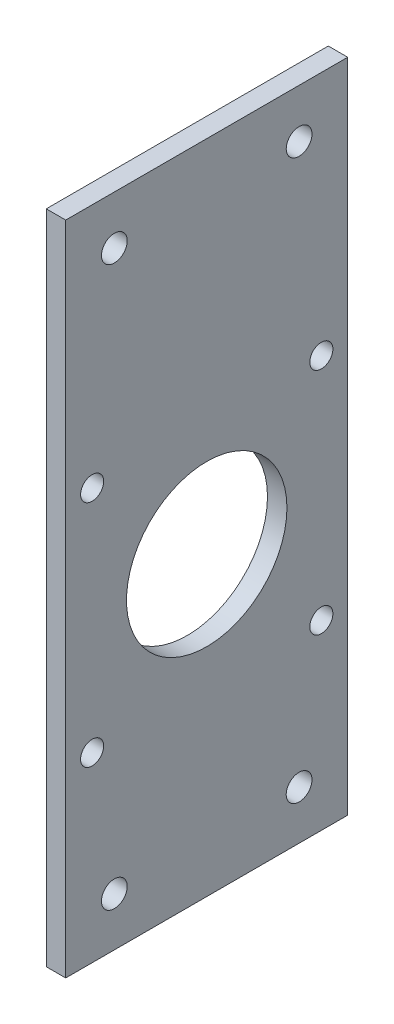
ISO-10303-21;
HEADER;
FILE_DESCRIPTION(('STEP AP214'),'2;1');
FILE_NAME('part.step','',(''),(''),'','','');
FILE_SCHEMA(('AUTOMOTIVE_DESIGN { 1 0 10303 214 1 1 1 1 }'));
ENDSEC;
DATA;
#1=APPLICATION_CONTEXT('core data for automotive mechanical design processes');
#2=APPLICATION_PROTOCOL_DEFINITION('international standard','automotive_design',2000,#1);
#3=PRODUCT_CONTEXT('',#1,'mechanical');
#4=PRODUCT('Part','Part','',(#3));
#5=PRODUCT_RELATED_PRODUCT_CATEGORY('part','',(#4));
#6=PRODUCT_DEFINITION_FORMATION('','',#4);
#7=PRODUCT_DEFINITION_CONTEXT('part definition',#1,'design');
#8=PRODUCT_DEFINITION('design','',#6,#7);
#9=PRODUCT_DEFINITION_SHAPE('','',#8);
#10=(LENGTH_UNIT() NAMED_UNIT(*) SI_UNIT(.MILLI.,.METRE.));
#11=(NAMED_UNIT(*) PLANE_ANGLE_UNIT() SI_UNIT($,.RADIAN.));
#12=(NAMED_UNIT(*) SI_UNIT($,.STERADIAN.) SOLID_ANGLE_UNIT());
#13=UNCERTAINTY_MEASURE_WITH_UNIT(LENGTH_MEASURE(1.E-05),#10,'distance_accuracy_value','');
#14=(GEOMETRIC_REPRESENTATION_CONTEXT(3) GLOBAL_UNCERTAINTY_ASSIGNED_CONTEXT((#13)) GLOBAL_UNIT_ASSIGNED_CONTEXT((#10,
#11,#12)) REPRESENTATION_CONTEXT('',''));
#15=CARTESIAN_POINT('',(0.,0.,0.));
#16=DIRECTION('',(0.,0.,1.));
#17=DIRECTION('',(1.,0.,0.));
#18=AXIS2_PLACEMENT_3D('',#15,#16,#17);
#19=CARTESIAN_POINT('',(4.,0.,0.));
#20=DIRECTION('',(1.,0.,0.));
#21=DIRECTION('',(0.,0.,-1.));
#22=AXIS2_PLACEMENT_3D('',#19,#20,#21);
#23=PLANE('',#22);
#24=CARTESIAN_POINT('',(4.,-57.4999999999999,19.));
#25=DIRECTION('',(1.,0.,0.));
#26=DIRECTION('',(0.,0.,1.));
#27=AXIS2_PLACEMENT_3D('',#24,#25,#26);
#28=CIRCLE('',#27,2.65);
#29=CARTESIAN_POINT('',(4.,-57.4999999999999,21.65));
#30=VERTEX_POINT('',#29);
#31=EDGE_CURVE('E151',#30,#30,#28,.T.);
#32=ORIENTED_EDGE('',*,*,#31,.F.);
#33=EDGE_LOOP('',(#32));
#34=FACE_BOUND('',#33,.T.);
#35=CARTESIAN_POINT('',(4.,57.5,19.));
#36=DIRECTION('',(1.,0.,0.));
#37=DIRECTION('',(0.,0.,-1.));
#38=AXIS2_PLACEMENT_3D('',#35,#36,#37);
#39=CIRCLE('',#38,2.65);
#40=CARTESIAN_POINT('',(4.,57.5,16.35));
#41=VERTEX_POINT('',#40);
#42=EDGE_CURVE('E139',#41,#41,#39,.T.);
#43=ORIENTED_EDGE('',*,*,#42,.F.);
#44=EDGE_LOOP('',(#43));
#45=FACE_BOUND('',#44,.T.);
#46=CARTESIAN_POINT('',(4.,-30.07,23.57));
#47=DIRECTION('',(1.,0.,0.));
#48=DIRECTION('',(0.,0.,-1.));
#49=AXIS2_PLACEMENT_3D('',#46,#47,#48);
#50=CIRCLE('',#49,2.375);
#51=CARTESIAN_POINT('',(4.,-30.07,21.195));
#52=VERTEX_POINT('',#51);
#53=EDGE_CURVE('E127',#52,#52,#50,.T.);
#54=ORIENTED_EDGE('',*,*,#53,.F.);
#55=EDGE_LOOP('',(#54));
#56=FACE_BOUND('',#55,.T.);
#57=CARTESIAN_POINT('',(4.,17.07,-23.57));
#58=DIRECTION('',(1.,0.,0.));
#59=DIRECTION('',(0.,0.,-1.));
#60=AXIS2_PLACEMENT_3D('',#57,#58,#59);
#61=CIRCLE('',#60,2.375);
#62=CARTESIAN_POINT('',(4.,17.07,-25.945));
#63=VERTEX_POINT('',#62);
#64=EDGE_CURVE('E115',#63,#63,#61,.T.);
#65=ORIENTED_EDGE('',*,*,#64,.F.);
#66=EDGE_LOOP('',(#65));
#67=FACE_BOUND('',#66,.T.);
#68=DIRECTION('',(0.,-1.,0.));
#69=VECTOR('',#68,1.);
#70=CARTESIAN_POINT('',(4.,-67.5,29.));
#71=LINE('',#70,#69);
#72=CARTESIAN_POINT('',(4.,67.5,29.));
#73=VERTEX_POINT('',#72);
#74=CARTESIAN_POINT('',(4.,-67.5,29.));
#75=VERTEX_POINT('',#74);
#76=EDGE_CURVE('E85',#73,#75,#71,.T.);
#77=ORIENTED_EDGE('',*,*,#76,.T.);
#78=DIRECTION('',(0.,0.,-1.));
#79=VECTOR('',#78,1.);
#80=CARTESIAN_POINT('',(4.,-67.5,-29.));
#81=LINE('',#80,#79);
#82=CARTESIAN_POINT('',(4.,-67.5,-29.));
#83=VERTEX_POINT('',#82);
#84=EDGE_CURVE('E80',#75,#83,#81,.T.);
#85=ORIENTED_EDGE('',*,*,#84,.T.);
#86=DIRECTION('',(0.,1.,0.));
#87=VECTOR('',#86,1.);
#88=CARTESIAN_POINT('',(4.,-67.5,-29.));
#89=LINE('',#88,#87);
#90=CARTESIAN_POINT('',(4.,67.5,-29.));
#91=VERTEX_POINT('',#90);
#92=EDGE_CURVE('E83',#83,#91,#89,.T.);
#93=ORIENTED_EDGE('',*,*,#92,.T.);
#94=DIRECTION('',(0.,0.,1.));
#95=VECTOR('',#94,1.);
#96=CARTESIAN_POINT('',(4.,67.5,-29.));
#97=LINE('',#96,#95);
#98=EDGE_CURVE('E50',#91,#73,#97,.T.);
#99=ORIENTED_EDGE('',*,*,#98,.T.);
#100=EDGE_LOOP('',(#77,#85,#93,#99));
#101=FACE_BOUND('',#100,.T.);
#102=CARTESIAN_POINT('',(4.,-6.50000000000001,0.));
#103=DIRECTION('',(1.,0.,0.));
#104=DIRECTION('',(0.,0.,-1.));
#105=AXIS2_PLACEMENT_3D('',#102,#103,#104);
#106=CIRCLE('',#105,16.5);
#107=CARTESIAN_POINT('',(4.,-6.50000000000001,-16.5));
#108=VERTEX_POINT('',#107);
#109=EDGE_CURVE('E100',#108,#108,#106,.T.);
#110=ORIENTED_EDGE('',*,*,#109,.F.);
#111=EDGE_LOOP('',(#110));
#112=FACE_BOUND('',#111,.T.);
#113=CARTESIAN_POINT('',(4.,17.07,23.57));
#114=DIRECTION('',(1.,0.,0.));
#115=DIRECTION('',(0.,0.,1.));
#116=AXIS2_PLACEMENT_3D('',#113,#114,#115);
#117=CIRCLE('',#116,2.375);
#118=CARTESIAN_POINT('',(4.,17.07,25.945));
#119=VERTEX_POINT('',#118);
#120=EDGE_CURVE('E121',#119,#119,#117,.T.);
#121=ORIENTED_EDGE('',*,*,#120,.F.);
#122=EDGE_LOOP('',(#121));
#123=FACE_BOUND('',#122,.T.);
#124=CARTESIAN_POINT('',(4.,-30.07,-23.57));
#125=DIRECTION('',(1.,0.,0.));
#126=DIRECTION('',(0.,0.,1.));
#127=AXIS2_PLACEMENT_3D('',#124,#125,#126);
#128=CIRCLE('',#127,2.375);
#129=CARTESIAN_POINT('',(4.,-30.07,-21.195));
#130=VERTEX_POINT('',#129);
#131=EDGE_CURVE('E133',#130,#130,#128,.T.);
#132=ORIENTED_EDGE('',*,*,#131,.F.);
#133=EDGE_LOOP('',(#132));
#134=FACE_BOUND('',#133,.T.);
#135=CARTESIAN_POINT('',(4.,57.5,-19.));
#136=DIRECTION('',(1.,0.,0.));
#137=DIRECTION('',(0.,0.,1.));
#138=AXIS2_PLACEMENT_3D('',#135,#136,#137);
#139=CIRCLE('',#138,2.65);
#140=CARTESIAN_POINT('',(4.,57.5,-16.35));
#141=VERTEX_POINT('',#140);
#142=EDGE_CURVE('E145',#141,#141,#139,.T.);
#143=ORIENTED_EDGE('',*,*,#142,.F.);
#144=EDGE_LOOP('',(#143));
#145=FACE_BOUND('',#144,.T.);
#146=CARTESIAN_POINT('',(4.,-57.5,-19.));
#147=DIRECTION('',(1.,0.,0.));
#148=DIRECTION('',(0.,0.,-1.));
#149=AXIS2_PLACEMENT_3D('',#146,#147,#148);
#150=CIRCLE('',#149,2.65);
#151=CARTESIAN_POINT('',(4.,-57.5,-21.65));
#152=VERTEX_POINT('',#151);
#153=EDGE_CURVE('E157',#152,#152,#150,.T.);
#154=ORIENTED_EDGE('',*,*,#153,.F.);
#155=EDGE_LOOP('',(#154));
#156=FACE_BOUND('',#155,.T.);
#157=ADVANCED_FACE('F33',(#34,#45,#56,#67,#101,#112,#123,#134,#145,#156),#23,.T.);
#158=CARTESIAN_POINT('',(0.,0.,0.));
#159=DIRECTION('',(1.,0.,0.));
#160=DIRECTION('',(0.,0.,-1.));
#161=AXIS2_PLACEMENT_3D('',#158,#159,#160);
#162=PLANE('',#161);
#163=DIRECTION('',(0.,-1.,0.));
#164=VECTOR('',#163,1.);
#165=CARTESIAN_POINT('',(0.,-67.5,29.));
#166=LINE('',#165,#164);
#167=CARTESIAN_POINT('',(0.,67.5,29.));
#168=VERTEX_POINT('',#167);
#169=CARTESIAN_POINT('',(0.,-67.5,29.));
#170=VERTEX_POINT('',#169);
#171=EDGE_CURVE('E97',#168,#170,#166,.T.);
#172=ORIENTED_EDGE('',*,*,#171,.F.);
#173=DIRECTION('',(0.,0.,1.));
#174=VECTOR('',#173,1.);
#175=CARTESIAN_POINT('',(0.,67.5,-29.));
#176=LINE('',#175,#174);
#177=CARTESIAN_POINT('',(0.,67.5,-29.));
#178=VERTEX_POINT('',#177);
#179=EDGE_CURVE('E73',#178,#168,#176,.T.);
#180=ORIENTED_EDGE('',*,*,#179,.F.);
#181=DIRECTION('',(0.,1.,0.));
#182=VECTOR('',#181,1.);
#183=CARTESIAN_POINT('',(0.,-67.5,-29.));
#184=LINE('',#183,#182);
#185=CARTESIAN_POINT('',(0.,-67.5,-29.));
#186=VERTEX_POINT('',#185);
#187=EDGE_CURVE('E67',#186,#178,#184,.T.);
#188=ORIENTED_EDGE('',*,*,#187,.F.);
#189=DIRECTION('',(0.,0.,-1.));
#190=VECTOR('',#189,1.);
#191=CARTESIAN_POINT('',(0.,-67.5,-29.));
#192=LINE('',#191,#190);
#193=EDGE_CURVE('E89',#170,#186,#192,.T.);
#194=ORIENTED_EDGE('',*,*,#193,.F.);
#195=EDGE_LOOP('',(#172,#180,#188,#194));
#196=FACE_BOUND('',#195,.T.);
#197=CARTESIAN_POINT('',(0.,-6.50000000000001,0.));
#198=DIRECTION('',(1.,0.,0.));
#199=DIRECTION('',(0.,0.,-1.));
#200=AXIS2_PLACEMENT_3D('',#197,#198,#199);
#201=CIRCLE('',#200,16.5);
#202=CARTESIAN_POINT('',(0.,-6.50000000000001,-16.5));
#203=VERTEX_POINT('',#202);
#204=EDGE_CURVE('E112',#203,#203,#201,.T.);
#205=ORIENTED_EDGE('',*,*,#204,.T.);
#206=EDGE_LOOP('',(#205));
#207=FACE_BOUND('',#206,.T.);
#208=CARTESIAN_POINT('',(0.,17.07,-23.57));
#209=DIRECTION('',(1.,0.,0.));
#210=DIRECTION('',(0.,0.,-1.));
#211=AXIS2_PLACEMENT_3D('',#208,#209,#210);
#212=CIRCLE('',#211,2.375);
#213=CARTESIAN_POINT('',(0.,17.07,-25.945));
#214=VERTEX_POINT('',#213);
#215=EDGE_CURVE('E118',#214,#214,#212,.T.);
#216=ORIENTED_EDGE('',*,*,#215,.T.);
#217=EDGE_LOOP('',(#216));
#218=FACE_BOUND('',#217,.T.);
#219=CARTESIAN_POINT('',(0.,17.07,23.57));
#220=DIRECTION('',(1.,0.,0.));
#221=DIRECTION('',(0.,0.,1.));
#222=AXIS2_PLACEMENT_3D('',#219,#220,#221);
#223=CIRCLE('',#222,2.375);
#224=CARTESIAN_POINT('',(0.,17.07,25.945));
#225=VERTEX_POINT('',#224);
#226=EDGE_CURVE('E124',#225,#225,#223,.T.);
#227=ORIENTED_EDGE('',*,*,#226,.T.);
#228=EDGE_LOOP('',(#227));
#229=FACE_BOUND('',#228,.T.);
#230=CARTESIAN_POINT('',(0.,-30.07,23.57));
#231=DIRECTION('',(1.,0.,0.));
#232=DIRECTION('',(0.,0.,-1.));
#233=AXIS2_PLACEMENT_3D('',#230,#231,#232);
#234=CIRCLE('',#233,2.375);
#235=CARTESIAN_POINT('',(0.,-30.07,21.195));
#236=VERTEX_POINT('',#235);
#237=EDGE_CURVE('E130',#236,#236,#234,.T.);
#238=ORIENTED_EDGE('',*,*,#237,.T.);
#239=EDGE_LOOP('',(#238));
#240=FACE_BOUND('',#239,.T.);
#241=CARTESIAN_POINT('',(0.,-30.07,-23.57));
#242=DIRECTION('',(1.,0.,0.));
#243=DIRECTION('',(0.,0.,1.));
#244=AXIS2_PLACEMENT_3D('',#241,#242,#243);
#245=CIRCLE('',#244,2.375);
#246=CARTESIAN_POINT('',(0.,-30.07,-21.195));
#247=VERTEX_POINT('',#246);
#248=EDGE_CURVE('E136',#247,#247,#245,.T.);
#249=ORIENTED_EDGE('',*,*,#248,.T.);
#250=EDGE_LOOP('',(#249));
#251=FACE_BOUND('',#250,.T.);
#252=CARTESIAN_POINT('',(0.,57.5,19.));
#253=DIRECTION('',(1.,0.,0.));
#254=DIRECTION('',(0.,0.,-1.));
#255=AXIS2_PLACEMENT_3D('',#252,#253,#254);
#256=CIRCLE('',#255,2.65);
#257=CARTESIAN_POINT('',(0.,57.5,16.35));
#258=VERTEX_POINT('',#257);
#259=EDGE_CURVE('E142',#258,#258,#256,.T.);
#260=ORIENTED_EDGE('',*,*,#259,.T.);
#261=EDGE_LOOP('',(#260));
#262=FACE_BOUND('',#261,.T.);
#263=CARTESIAN_POINT('',(0.,57.5,-19.));
#264=DIRECTION('',(1.,0.,0.));
#265=DIRECTION('',(0.,0.,1.));
#266=AXIS2_PLACEMENT_3D('',#263,#264,#265);
#267=CIRCLE('',#266,2.65);
#268=CARTESIAN_POINT('',(0.,57.5,-16.35));
#269=VERTEX_POINT('',#268);
#270=EDGE_CURVE('E148',#269,#269,#267,.T.);
#271=ORIENTED_EDGE('',*,*,#270,.T.);
#272=EDGE_LOOP('',(#271));
#273=FACE_BOUND('',#272,.T.);
#274=CARTESIAN_POINT('',(0.,-57.4999999999999,19.));
#275=DIRECTION('',(1.,0.,0.));
#276=DIRECTION('',(0.,0.,1.));
#277=AXIS2_PLACEMENT_3D('',#274,#275,#276);
#278=CIRCLE('',#277,2.65);
#279=CARTESIAN_POINT('',(0.,-57.4999999999999,21.65));
#280=VERTEX_POINT('',#279);
#281=EDGE_CURVE('E154',#280,#280,#278,.T.);
#282=ORIENTED_EDGE('',*,*,#281,.T.);
#283=EDGE_LOOP('',(#282));
#284=FACE_BOUND('',#283,.T.);
#285=CARTESIAN_POINT('',(0.,-57.5,-19.));
#286=DIRECTION('',(1.,0.,0.));
#287=DIRECTION('',(0.,0.,-1.));
#288=AXIS2_PLACEMENT_3D('',#285,#286,#287);
#289=CIRCLE('',#288,2.65);
#290=CARTESIAN_POINT('',(0.,-57.5,-21.65));
#291=VERTEX_POINT('',#290);
#292=EDGE_CURVE('E160',#291,#291,#289,.T.);
#293=ORIENTED_EDGE('',*,*,#292,.T.);
#294=EDGE_LOOP('',(#293));
#295=FACE_BOUND('',#294,.T.);
#296=ADVANCED_FACE('F108',(#196,#207,#218,#229,#240,#251,#262,#273,#284,#295),#162,.F.);
#297=CARTESIAN_POINT('',(4.,-67.5,29.));
#298=DIRECTION('',(0.,0.,-1.));
#299=DIRECTION('',(-1.,0.,0.));
#300=AXIS2_PLACEMENT_3D('',#297,#298,#299);
#301=PLANE('',#300);
#302=ORIENTED_EDGE('',*,*,#171,.T.);
#303=DIRECTION('',(-1.,0.,0.));
#304=VECTOR('',#303,1.);
#305=CARTESIAN_POINT('',(4.,-67.5,29.));
#306=LINE('',#305,#304);
#307=EDGE_CURVE('E11',#75,#170,#306,.T.);
#308=ORIENTED_EDGE('',*,*,#307,.F.);
#309=ORIENTED_EDGE('',*,*,#76,.F.);
#310=DIRECTION('',(-1.,0.,0.));
#311=VECTOR('',#310,1.);
#312=CARTESIAN_POINT('',(4.,67.5,29.));
#313=LINE('',#312,#311);
#314=EDGE_CURVE('E93',#73,#168,#313,.T.);
#315=ORIENTED_EDGE('',*,*,#314,.T.);
#316=EDGE_LOOP('',(#302,#308,#309,#315));
#317=FACE_BOUND('',#316,.T.);
#318=ADVANCED_FACE('F35',(#317),#301,.F.);
#319=CARTESIAN_POINT('',(4.,-67.5,-29.));
#320=DIRECTION('',(0.,1.,0.));
#321=DIRECTION('',(0.,0.,1.));
#322=AXIS2_PLACEMENT_3D('',#319,#320,#321);
#323=PLANE('',#322);
#324=ORIENTED_EDGE('',*,*,#193,.T.);
#325=DIRECTION('',(-1.,0.,0.));
#326=VECTOR('',#325,1.);
#327=CARTESIAN_POINT('',(4.,-67.5,-29.));
#328=LINE('',#327,#326);
#329=EDGE_CURVE('E42',#83,#186,#328,.T.);
#330=ORIENTED_EDGE('',*,*,#329,.F.);
#331=ORIENTED_EDGE('',*,*,#84,.F.);
#332=ORIENTED_EDGE('',*,*,#307,.T.);
#333=EDGE_LOOP('',(#324,#330,#331,#332));
#334=FACE_BOUND('',#333,.T.);
#335=ADVANCED_FACE('F88',(#334),#323,.F.);
#336=CARTESIAN_POINT('',(4.,-67.5,-29.));
#337=DIRECTION('',(0.,0.,1.));
#338=DIRECTION('',(0.,-1.,0.));
#339=AXIS2_PLACEMENT_3D('',#336,#337,#338);
#340=PLANE('',#339);
#341=ORIENTED_EDGE('',*,*,#187,.T.);
#342=DIRECTION('',(-1.,0.,0.));
#343=VECTOR('',#342,1.);
#344=CARTESIAN_POINT('',(4.,67.5,-29.));
#345=LINE('',#344,#343);
#346=EDGE_CURVE('E90',#91,#178,#345,.T.);
#347=ORIENTED_EDGE('',*,*,#346,.F.);
#348=ORIENTED_EDGE('',*,*,#92,.F.);
#349=ORIENTED_EDGE('',*,*,#329,.T.);
#350=EDGE_LOOP('',(#341,#347,#348,#349));
#351=FACE_BOUND('',#350,.T.);
#352=ADVANCED_FACE('F91',(#351),#340,.F.);
#353=CARTESIAN_POINT('',(4.,67.5,-29.));
#354=DIRECTION('',(0.,-1.,0.));
#355=DIRECTION('',(0.,0.,-1.));
#356=AXIS2_PLACEMENT_3D('',#353,#354,#355);
#357=PLANE('',#356);
#358=ORIENTED_EDGE('',*,*,#179,.T.);
#359=ORIENTED_EDGE('',*,*,#314,.F.);
#360=ORIENTED_EDGE('',*,*,#98,.F.);
#361=ORIENTED_EDGE('',*,*,#346,.T.);
#362=EDGE_LOOP('',(#358,#359,#360,#361));
#363=FACE_BOUND('',#362,.T.);
#364=ADVANCED_FACE('F105',(#363),#357,.F.);
#365=CARTESIAN_POINT('',(4.,-6.50000000000001,0.));
#366=DIRECTION('',(-1.,0.,0.));
#367=DIRECTION('',(0.,0.,1.));
#368=AXIS2_PLACEMENT_3D('',#365,#366,#367);
#369=CYLINDRICAL_SURFACE('',#368,16.5);
#370=ORIENTED_EDGE('',*,*,#109,.T.);
#371=EDGE_LOOP('',(#370));
#372=FACE_BOUND('',#371,.T.);
#373=ORIENTED_EDGE('',*,*,#204,.F.);
#374=EDGE_LOOP('',(#373));
#375=FACE_BOUND('',#374,.T.);
#376=ADVANCED_FACE('F179',(#372,#375),#369,.F.);
#377=CARTESIAN_POINT('',(4.,17.07,-23.57));
#378=DIRECTION('',(-1.,0.,0.));
#379=DIRECTION('',(0.,0.,1.));
#380=AXIS2_PLACEMENT_3D('',#377,#378,#379);
#381=CYLINDRICAL_SURFACE('',#380,2.375);
#382=ORIENTED_EDGE('',*,*,#64,.T.);
#383=EDGE_LOOP('',(#382));
#384=FACE_BOUND('',#383,.T.);
#385=ORIENTED_EDGE('',*,*,#215,.F.);
#386=EDGE_LOOP('',(#385));
#387=FACE_BOUND('',#386,.T.);
#388=ADVANCED_FACE('F225',(#384,#387),#381,.F.);
#389=CARTESIAN_POINT('',(4.,17.07,23.57));
#390=DIRECTION('',(-1.,0.,0.));
#391=DIRECTION('',(0.,0.,1.));
#392=AXIS2_PLACEMENT_3D('',#389,#390,#391);
#393=CYLINDRICAL_SURFACE('',#392,2.375);
#394=ORIENTED_EDGE('',*,*,#120,.T.);
#395=EDGE_LOOP('',(#394));
#396=FACE_BOUND('',#395,.T.);
#397=ORIENTED_EDGE('',*,*,#226,.F.);
#398=EDGE_LOOP('',(#397));
#399=FACE_BOUND('',#398,.T.);
#400=ADVANCED_FACE('F233',(#396,#399),#393,.F.);
#401=CARTESIAN_POINT('',(4.,-30.07,23.57));
#402=DIRECTION('',(-1.,0.,0.));
#403=DIRECTION('',(0.,0.,1.));
#404=AXIS2_PLACEMENT_3D('',#401,#402,#403);
#405=CYLINDRICAL_SURFACE('',#404,2.375);
#406=ORIENTED_EDGE('',*,*,#53,.T.);
#407=EDGE_LOOP('',(#406));
#408=FACE_BOUND('',#407,.T.);
#409=ORIENTED_EDGE('',*,*,#237,.F.);
#410=EDGE_LOOP('',(#409));
#411=FACE_BOUND('',#410,.T.);
#412=ADVANCED_FACE('F241',(#408,#411),#405,.F.);
#413=CARTESIAN_POINT('',(4.,-30.07,-23.57));
#414=DIRECTION('',(-1.,0.,0.));
#415=DIRECTION('',(0.,0.,1.));
#416=AXIS2_PLACEMENT_3D('',#413,#414,#415);
#417=CYLINDRICAL_SURFACE('',#416,2.375);
#418=ORIENTED_EDGE('',*,*,#131,.T.);
#419=EDGE_LOOP('',(#418));
#420=FACE_BOUND('',#419,.T.);
#421=ORIENTED_EDGE('',*,*,#248,.F.);
#422=EDGE_LOOP('',(#421));
#423=FACE_BOUND('',#422,.T.);
#424=ADVANCED_FACE('F250',(#420,#423),#417,.F.);
#425=CARTESIAN_POINT('',(4.,57.5,19.));
#426=DIRECTION('',(-1.,0.,0.));
#427=DIRECTION('',(0.,0.,1.));
#428=AXIS2_PLACEMENT_3D('',#425,#426,#427);
#429=CYLINDRICAL_SURFACE('',#428,2.65);
#430=ORIENTED_EDGE('',*,*,#42,.T.);
#431=EDGE_LOOP('',(#430));
#432=FACE_BOUND('',#431,.T.);
#433=ORIENTED_EDGE('',*,*,#259,.F.);
#434=EDGE_LOOP('',(#433));
#435=FACE_BOUND('',#434,.T.);
#436=ADVANCED_FACE('F259',(#432,#435),#429,.F.);
#437=CARTESIAN_POINT('',(4.,57.5,-19.));
#438=DIRECTION('',(-1.,0.,0.));
#439=DIRECTION('',(0.,0.,1.));
#440=AXIS2_PLACEMENT_3D('',#437,#438,#439);
#441=CYLINDRICAL_SURFACE('',#440,2.65);
#442=ORIENTED_EDGE('',*,*,#142,.T.);
#443=EDGE_LOOP('',(#442));
#444=FACE_BOUND('',#443,.T.);
#445=ORIENTED_EDGE('',*,*,#270,.F.);
#446=EDGE_LOOP('',(#445));
#447=FACE_BOUND('',#446,.T.);
#448=ADVANCED_FACE('F268',(#444,#447),#441,.F.);
#449=CARTESIAN_POINT('',(4.,-57.4999999999999,19.));
#450=DIRECTION('',(-1.,0.,0.));
#451=DIRECTION('',(0.,0.,1.));
#452=AXIS2_PLACEMENT_3D('',#449,#450,#451);
#453=CYLINDRICAL_SURFACE('',#452,2.65);
#454=ORIENTED_EDGE('',*,*,#31,.T.);
#455=EDGE_LOOP('',(#454));
#456=FACE_BOUND('',#455,.T.);
#457=ORIENTED_EDGE('',*,*,#281,.F.);
#458=EDGE_LOOP('',(#457));
#459=FACE_BOUND('',#458,.T.);
#460=ADVANCED_FACE('F277',(#456,#459),#453,.F.);
#461=CARTESIAN_POINT('',(4.,-57.5,-19.));
#462=DIRECTION('',(-1.,0.,0.));
#463=DIRECTION('',(0.,0.,1.));
#464=AXIS2_PLACEMENT_3D('',#461,#462,#463);
#465=CYLINDRICAL_SURFACE('',#464,2.65);
#466=ORIENTED_EDGE('',*,*,#153,.T.);
#467=EDGE_LOOP('',(#466));
#468=FACE_BOUND('',#467,.T.);
#469=ORIENTED_EDGE('',*,*,#292,.F.);
#470=EDGE_LOOP('',(#469));
#471=FACE_BOUND('',#470,.T.);
#472=ADVANCED_FACE('F166',(#468,#471),#465,.F.);
#473=CLOSED_SHELL('',(#157,#296,#318,#335,#352,#364,#376,#388,#400,#412,#424,#436,#448,#460,#472));
#474=MANIFOLD_SOLID_BREP('B2',#473);
#475=ADVANCED_BREP_SHAPE_REPRESENTATION('',(#18,#474),#14);
#476=SHAPE_DEFINITION_REPRESENTATION(#9,#475);
ENDSEC;
END-ISO-10303-21;
